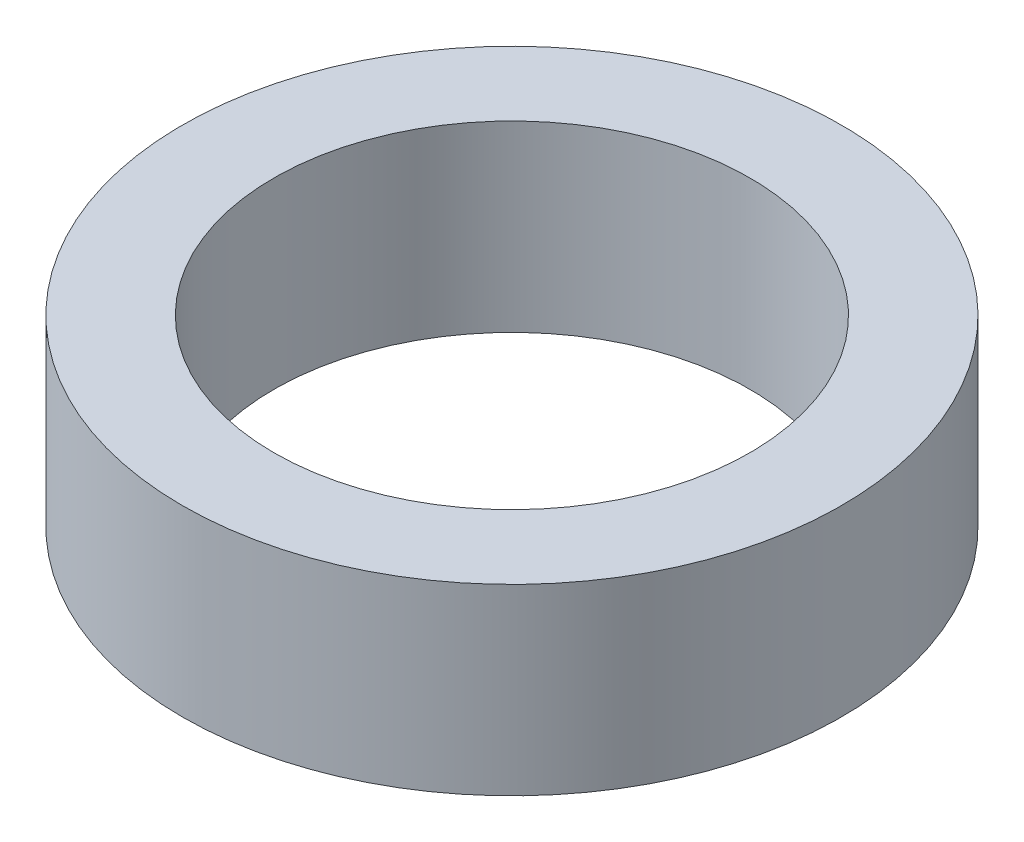
ISO-10303-21;
HEADER;
FILE_DESCRIPTION(('STEP AP214'),'2;1');
FILE_NAME('part.step','',(''),(''),'','','');
FILE_SCHEMA(('AUTOMOTIVE_DESIGN { 1 0 10303 214 1 1 1 1 }'));
ENDSEC;
DATA;
#1=APPLICATION_CONTEXT('core data for automotive mechanical design processes');
#2=APPLICATION_PROTOCOL_DEFINITION('international standard','automotive_design',2000,#1);
#3=PRODUCT_CONTEXT('',#1,'mechanical');
#4=PRODUCT('Part','Part','',(#3));
#5=PRODUCT_RELATED_PRODUCT_CATEGORY('part','',(#4));
#6=PRODUCT_DEFINITION_FORMATION('','',#4);
#7=PRODUCT_DEFINITION_CONTEXT('part definition',#1,'design');
#8=PRODUCT_DEFINITION('design','',#6,#7);
#9=PRODUCT_DEFINITION_SHAPE('','',#8);
#10=(LENGTH_UNIT() NAMED_UNIT(*) SI_UNIT(.MILLI.,.METRE.));
#11=(NAMED_UNIT(*) PLANE_ANGLE_UNIT() SI_UNIT($,.RADIAN.));
#12=(NAMED_UNIT(*) SI_UNIT($,.STERADIAN.) SOLID_ANGLE_UNIT());
#13=UNCERTAINTY_MEASURE_WITH_UNIT(LENGTH_MEASURE(1.E-05),#10,'distance_accuracy_value','');
#14=(GEOMETRIC_REPRESENTATION_CONTEXT(3) GLOBAL_UNCERTAINTY_ASSIGNED_CONTEXT((#13)) GLOBAL_UNIT_ASSIGNED_CONTEXT((#10,
#11,#12)) REPRESENTATION_CONTEXT('',''));
#15=CARTESIAN_POINT('',(0.,0.,0.));
#16=DIRECTION('',(0.,0.,1.));
#17=DIRECTION('',(1.,0.,0.));
#18=AXIS2_PLACEMENT_3D('',#15,#16,#17);
#19=CARTESIAN_POINT('',(0.,11.2232142857143,0.));
#20=DIRECTION('',(0.,1.,0.));
#21=DIRECTION('',(0.,0.,1.));
#22=AXIS2_PLACEMENT_3D('',#19,#20,#21);
#23=CYLINDRICAL_SURFACE('',#22,13.);
#24=CARTESIAN_POINT('',(0.,-3.7227091274258,0.));
#25=DIRECTION('',(0.,1.,0.));
#26=DIRECTION('',(0.,0.,1.));
#27=AXIS2_PLACEMENT_3D('',#24,#25,#26);
#28=CIRCLE('',#27,13.);
#29=CARTESIAN_POINT('',(0.,-3.7227091274258,13.));
#30=VERTEX_POINT('',#29);
#31=EDGE_CURVE('E56',#30,#30,#28,.T.);
#32=ORIENTED_EDGE('',*,*,#31,.F.);
#33=EDGE_LOOP('',(#32));
#34=FACE_BOUND('',#33,.T.);
#35=CARTESIAN_POINT('',(0.,6.2772908725742,0.));
#36=DIRECTION('',(0.,1.,0.));
#37=DIRECTION('',(0.,0.,1.));
#38=AXIS2_PLACEMENT_3D('',#35,#36,#37);
#39=CIRCLE('',#38,13.);
#40=CARTESIAN_POINT('',(0.,6.2772908725742,13.));
#41=VERTEX_POINT('',#40);
#42=EDGE_CURVE('E10',#41,#41,#39,.T.);
#43=ORIENTED_EDGE('',*,*,#42,.T.);
#44=EDGE_LOOP('',(#43));
#45=FACE_BOUND('',#44,.T.);
#46=ADVANCED_FACE('F39',(#34,#45),#23,.F.);
#47=CARTESIAN_POINT('',(18.,6.2772908725742,0.));
#48=DIRECTION('',(0.,-1.,0.));
#49=DIRECTION('',(0.,0.,-1.));
#50=AXIS2_PLACEMENT_3D('',#47,#48,#49);
#51=PLANE('',#50);
#52=ORIENTED_EDGE('',*,*,#42,.F.);
#53=EDGE_LOOP('',(#52));
#54=FACE_BOUND('',#53,.T.);
#55=CARTESIAN_POINT('',(0.,6.2772908725742,0.));
#56=DIRECTION('',(0.,1.,0.));
#57=DIRECTION('',(0.,0.,1.));
#58=AXIS2_PLACEMENT_3D('',#55,#56,#57);
#59=CIRCLE('',#58,18.);
#60=CARTESIAN_POINT('',(0.,6.2772908725742,18.));
#61=VERTEX_POINT('',#60);
#62=EDGE_CURVE('E46',#61,#61,#59,.T.);
#63=ORIENTED_EDGE('',*,*,#62,.T.);
#64=EDGE_LOOP('',(#63));
#65=FACE_BOUND('',#64,.T.);
#66=ADVANCED_FACE('F66',(#54,#65),#51,.F.);
#67=CARTESIAN_POINT('',(0.,11.2232142857143,0.));
#68=DIRECTION('',(0.,1.,0.));
#69=DIRECTION('',(0.,0.,1.));
#70=AXIS2_PLACEMENT_3D('',#67,#68,#69);
#71=CYLINDRICAL_SURFACE('',#70,18.);
#72=ORIENTED_EDGE('',*,*,#62,.F.);
#73=EDGE_LOOP('',(#72));
#74=FACE_BOUND('',#73,.T.);
#75=CARTESIAN_POINT('',(0.,-3.7227091274258,0.));
#76=DIRECTION('',(0.,1.,0.));
#77=DIRECTION('',(0.,0.,1.));
#78=AXIS2_PLACEMENT_3D('',#75,#76,#77);
#79=CIRCLE('',#78,18.);
#80=CARTESIAN_POINT('',(0.,-3.7227091274258,18.));
#81=VERTEX_POINT('',#80);
#82=EDGE_CURVE('E51',#81,#81,#79,.T.);
#83=ORIENTED_EDGE('',*,*,#82,.T.);
#84=EDGE_LOOP('',(#83));
#85=FACE_BOUND('',#84,.T.);
#86=ADVANCED_FACE('F70',(#74,#85),#71,.T.);
#87=CARTESIAN_POINT('',(18.,-3.7227091274258,0.));
#88=DIRECTION('',(0.,1.,0.));
#89=DIRECTION('',(0.,0.,1.));
#90=AXIS2_PLACEMENT_3D('',#87,#88,#89);
#91=PLANE('',#90);
#92=ORIENTED_EDGE('',*,*,#82,.F.);
#93=EDGE_LOOP('',(#92));
#94=FACE_BOUND('',#93,.T.);
#95=ORIENTED_EDGE('',*,*,#31,.T.);
#96=EDGE_LOOP('',(#95));
#97=FACE_BOUND('',#96,.T.);
#98=ADVANCED_FACE('F63',(#94,#97),#91,.F.);
#99=CLOSED_SHELL('',(#46,#66,#86,#98));
#100=MANIFOLD_SOLID_BREP('B2',#99);
#101=ADVANCED_BREP_SHAPE_REPRESENTATION('',(#18,#100),#14);
#102=SHAPE_DEFINITION_REPRESENTATION(#9,#101);
ENDSEC;
END-ISO-10303-21;
